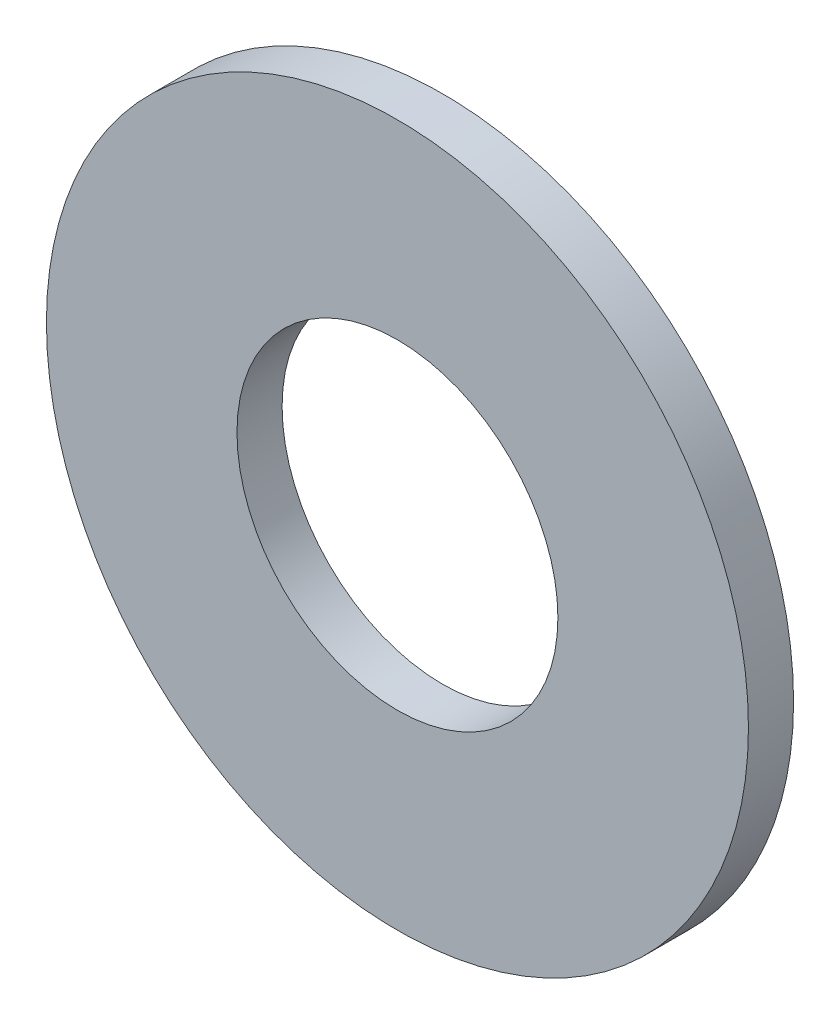
ISO-10303-21;
HEADER;
FILE_DESCRIPTION(('STEP AP214'),'2;1');
FILE_NAME('part.step','',(''),(''),'','','');
FILE_SCHEMA(('AUTOMOTIVE_DESIGN { 1 0 10303 214 1 1 1 1 }'));
ENDSEC;
DATA;
#1=APPLICATION_CONTEXT('core data for automotive mechanical design processes');
#2=APPLICATION_PROTOCOL_DEFINITION('international standard','automotive_design',2000,#1);
#3=PRODUCT_CONTEXT('',#1,'mechanical');
#4=PRODUCT('Part','Part','',(#3));
#5=PRODUCT_RELATED_PRODUCT_CATEGORY('part','',(#4));
#6=PRODUCT_DEFINITION_FORMATION('','',#4);
#7=PRODUCT_DEFINITION_CONTEXT('part definition',#1,'design');
#8=PRODUCT_DEFINITION('design','',#6,#7);
#9=PRODUCT_DEFINITION_SHAPE('','',#8);
#10=(LENGTH_UNIT() NAMED_UNIT(*) SI_UNIT(.MILLI.,.METRE.));
#11=(NAMED_UNIT(*) PLANE_ANGLE_UNIT() SI_UNIT($,.RADIAN.));
#12=(NAMED_UNIT(*) SI_UNIT($,.STERADIAN.) SOLID_ANGLE_UNIT());
#13=UNCERTAINTY_MEASURE_WITH_UNIT(LENGTH_MEASURE(1.E-05),#10,'distance_accuracy_value','');
#14=(GEOMETRIC_REPRESENTATION_CONTEXT(3) GLOBAL_UNCERTAINTY_ASSIGNED_CONTEXT((#13)) GLOBAL_UNIT_ASSIGNED_CONTEXT((#10,
#11,#12)) REPRESENTATION_CONTEXT('',''));
#15=CARTESIAN_POINT('',(0.,0.,0.));
#16=DIRECTION('',(0.,0.,1.));
#17=DIRECTION('',(1.,0.,0.));
#18=AXIS2_PLACEMENT_3D('',#15,#16,#17);
#19=CARTESIAN_POINT('',(0.,0.,-0.45));
#20=DIRECTION('',(0.,0.,1.));
#21=DIRECTION('',(1.,0.,0.));
#22=AXIS2_PLACEMENT_3D('',#19,#20,#21);
#23=CYLINDRICAL_SURFACE('',#22,3.5);
#24=CARTESIAN_POINT('',(0.,0.,-0.45));
#25=DIRECTION('',(0.,0.,1.));
#26=DIRECTION('',(1.,0.,0.));
#27=AXIS2_PLACEMENT_3D('',#24,#25,#26);
#28=CIRCLE('',#27,3.5);
#29=CARTESIAN_POINT('',(3.5,0.,-0.45));
#30=VERTEX_POINT('',#29);
#31=EDGE_CURVE('E10',#30,#30,#28,.T.);
#32=ORIENTED_EDGE('',*,*,#31,.T.);
#33=EDGE_LOOP('',(#32));
#34=FACE_BOUND('',#33,.T.);
#35=CARTESIAN_POINT('',(0.,0.,0.));
#36=DIRECTION('',(0.,0.,1.));
#37=DIRECTION('',(1.,0.,0.));
#38=AXIS2_PLACEMENT_3D('',#35,#36,#37);
#39=CIRCLE('',#38,3.5);
#40=CARTESIAN_POINT('',(3.5,0.,0.));
#41=VERTEX_POINT('',#40);
#42=EDGE_CURVE('E33',#41,#41,#39,.T.);
#43=ORIENTED_EDGE('',*,*,#42,.F.);
#44=EDGE_LOOP('',(#43));
#45=FACE_BOUND('',#44,.T.);
#46=ADVANCED_FACE('F30',(#34,#45),#23,.T.);
#47=CARTESIAN_POINT('',(0.,0.,-0.45));
#48=DIRECTION('',(0.,0.,1.));
#49=DIRECTION('',(1.,0.,0.));
#50=AXIS2_PLACEMENT_3D('',#47,#48,#49);
#51=PLANE('',#50);
#52=CARTESIAN_POINT('',(0.,0.,-0.45));
#53=DIRECTION('',(0.,0.,1.));
#54=DIRECTION('',(1.,0.,0.));
#55=AXIS2_PLACEMENT_3D('',#52,#53,#54);
#56=CIRCLE('',#55,1.6);
#57=CARTESIAN_POINT('',(1.6,0.,-0.45));
#58=VERTEX_POINT('',#57);
#59=EDGE_CURVE('E40',#58,#58,#56,.T.);
#60=ORIENTED_EDGE('',*,*,#59,.T.);
#61=EDGE_LOOP('',(#60));
#62=FACE_BOUND('',#61,.T.);
#63=ORIENTED_EDGE('',*,*,#31,.F.);
#64=EDGE_LOOP('',(#63));
#65=FACE_BOUND('',#64,.T.);
#66=ADVANCED_FACE('F48',(#62,#65),#51,.F.);
#67=CARTESIAN_POINT('',(0.,0.,0.));
#68=DIRECTION('',(0.,0.,1.));
#69=DIRECTION('',(1.,0.,0.));
#70=AXIS2_PLACEMENT_3D('',#67,#68,#69);
#71=PLANE('',#70);
#72=CARTESIAN_POINT('',(0.,0.,0.));
#73=DIRECTION('',(0.,0.,1.));
#74=DIRECTION('',(1.,0.,0.));
#75=AXIS2_PLACEMENT_3D('',#72,#73,#74);
#76=CIRCLE('',#75,1.6);
#77=CARTESIAN_POINT('',(1.6,0.,0.));
#78=VERTEX_POINT('',#77);
#79=EDGE_CURVE('E42',#78,#78,#76,.T.);
#80=ORIENTED_EDGE('',*,*,#79,.F.);
#81=EDGE_LOOP('',(#80));
#82=FACE_BOUND('',#81,.T.);
#83=ORIENTED_EDGE('',*,*,#42,.T.);
#84=EDGE_LOOP('',(#83));
#85=FACE_BOUND('',#84,.T.);
#86=ADVANCED_FACE('F54',(#82,#85),#71,.T.);
#87=CARTESIAN_POINT('',(0.,0.,-0.45));
#88=DIRECTION('',(0.,0.,1.));
#89=DIRECTION('',(1.,0.,0.));
#90=AXIS2_PLACEMENT_3D('',#87,#88,#89);
#91=CYLINDRICAL_SURFACE('',#90,1.6);
#92=ORIENTED_EDGE('',*,*,#59,.F.);
#93=EDGE_LOOP('',(#92));
#94=FACE_BOUND('',#93,.T.);
#95=ORIENTED_EDGE('',*,*,#79,.T.);
#96=EDGE_LOOP('',(#95));
#97=FACE_BOUND('',#96,.T.);
#98=ADVANCED_FACE('F51',(#94,#97),#91,.F.);
#99=CLOSED_SHELL('',(#46,#66,#86,#98));
#100=MANIFOLD_SOLID_BREP('B2',#99);
#101=ADVANCED_BREP_SHAPE_REPRESENTATION('',(#18,#100),#14);
#102=SHAPE_DEFINITION_REPRESENTATION(#9,#101);
ENDSEC;
END-ISO-10303-21;
